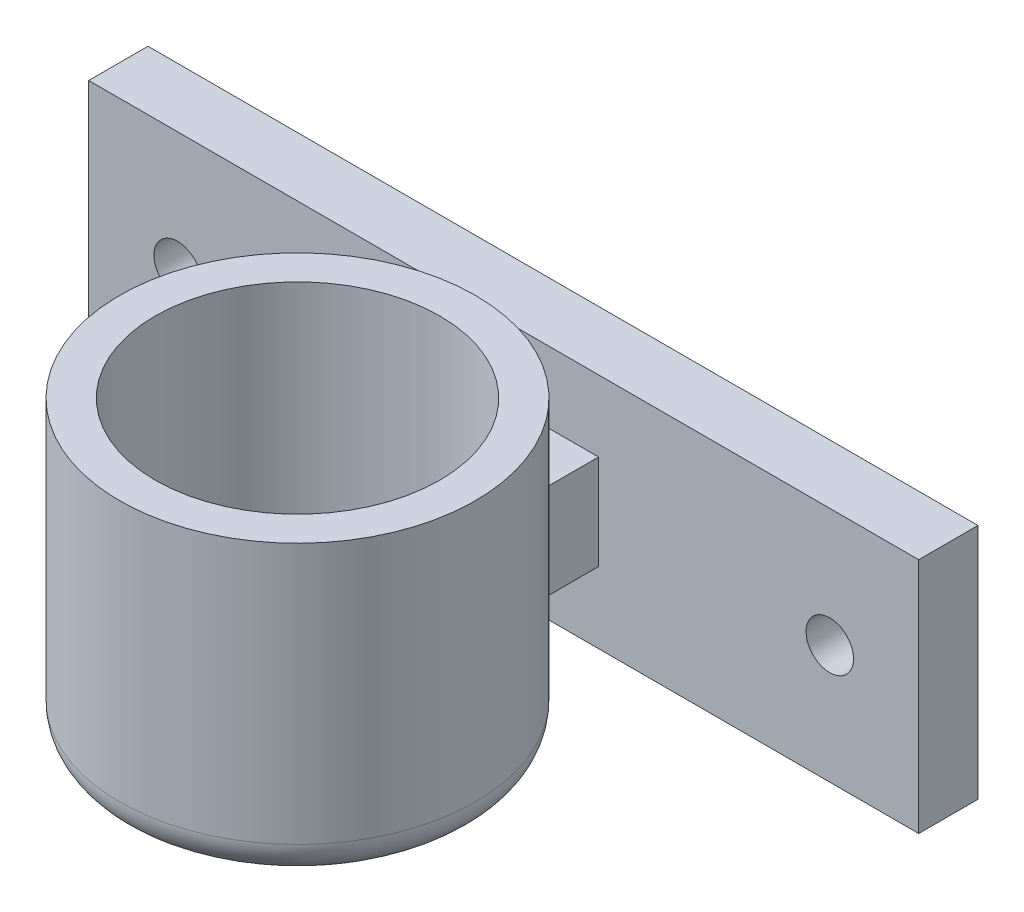
ISO-10303-21;
HEADER;
FILE_DESCRIPTION(('STEP AP214'),'2;1');
FILE_NAME('part.step','',(''),(''),'','','');
FILE_SCHEMA(('AUTOMOTIVE_DESIGN { 1 0 10303 214 1 1 1 1 }'));
ENDSEC;
DATA;
#1=APPLICATION_CONTEXT('core data for automotive mechanical design processes');
#2=APPLICATION_PROTOCOL_DEFINITION('international standard','automotive_design',2000,#1);
#3=PRODUCT_CONTEXT('',#1,'mechanical');
#4=PRODUCT('Part','Part','',(#3));
#5=PRODUCT_RELATED_PRODUCT_CATEGORY('part','',(#4));
#6=PRODUCT_DEFINITION_FORMATION('','',#4);
#7=PRODUCT_DEFINITION_CONTEXT('part definition',#1,'design');
#8=PRODUCT_DEFINITION('design','',#6,#7);
#9=PRODUCT_DEFINITION_SHAPE('','',#8);
#10=(LENGTH_UNIT() NAMED_UNIT(*) SI_UNIT(.MILLI.,.METRE.));
#11=(NAMED_UNIT(*) PLANE_ANGLE_UNIT() SI_UNIT($,.RADIAN.));
#12=(NAMED_UNIT(*) SI_UNIT($,.STERADIAN.) SOLID_ANGLE_UNIT());
#13=UNCERTAINTY_MEASURE_WITH_UNIT(LENGTH_MEASURE(1.E-05),#10,'distance_accuracy_value','');
#14=(GEOMETRIC_REPRESENTATION_CONTEXT(3) GLOBAL_UNCERTAINTY_ASSIGNED_CONTEXT((#13)) GLOBAL_UNIT_ASSIGNED_CONTEXT((#10,
#11,#12)) REPRESENTATION_CONTEXT('',''));
#15=CARTESIAN_POINT('',(0.,0.,0.));
#16=DIRECTION('',(0.,0.,1.));
#17=DIRECTION('',(1.,0.,0.));
#18=AXIS2_PLACEMENT_3D('',#15,#16,#17);
#19=CARTESIAN_POINT('',(-2.34426229508198,24.655737704918,7.5));
#20=DIRECTION('',(1.,0.,0.));
#21=DIRECTION('',(0.,1.,0.));
#22=AXIS2_PLACEMENT_3D('',#19,#20,#21);
#23=PLANE('',#22);
#24=DIRECTION('',(0.,1.,0.));
#25=VECTOR('',#24,1.);
#26=CARTESIAN_POINT('',(-2.34426229508197,11.655737704918,7.20006627770313));
#27=LINE('',#26,#25);
#28=CARTESIAN_POINT('',(-2.34426229508198,24.655737704918,7.20006627770313));
#29=VERTEX_POINT('',#28);
#30=CARTESIAN_POINT('',(-2.34426229508198,16.655737704918,7.20006627770313));
#31=VERTEX_POINT('',#30);
#32=EDGE_CURVE('E115',#29,#31,#27,.F.);
#33=ORIENTED_EDGE('',*,*,#32,.F.);
#34=DIRECTION('',(0.,0.,-1.));
#35=VECTOR('',#34,1.);
#36=CARTESIAN_POINT('',(-2.34426229508198,24.655737704918,7.5));
#37=LINE('',#36,#35);
#38=CARTESIAN_POINT('',(-2.34426229508198,24.655737704918,2.5));
#39=VERTEX_POINT('',#38);
#40=EDGE_CURVE('E101',#29,#39,#37,.T.);
#41=ORIENTED_EDGE('',*,*,#40,.T.);
#42=DIRECTION('',(0.,-1.,0.));
#43=VECTOR('',#42,1.);
#44=CARTESIAN_POINT('',(-2.34426229508198,24.655737704918,2.5));
#45=LINE('',#44,#43);
#46=CARTESIAN_POINT('',(-2.34426229508198,16.655737704918,2.5));
#47=VERTEX_POINT('',#46);
#48=EDGE_CURVE('E117',#39,#47,#45,.T.);
#49=ORIENTED_EDGE('',*,*,#48,.T.);
#50=DIRECTION('',(0.,0.,-1.));
#51=VECTOR('',#50,1.);
#52=CARTESIAN_POINT('',(-2.34426229508198,16.655737704918,7.5));
#53=LINE('',#52,#51);
#54=EDGE_CURVE('E112',#31,#47,#53,.T.);
#55=ORIENTED_EDGE('',*,*,#54,.F.);
#56=EDGE_LOOP('',(#33,#41,#49,#55));
#57=FACE_BOUND('',#56,.T.);
#58=ADVANCED_FACE('F36',(#57),#23,.F.);
#59=CARTESIAN_POINT('',(13.655737704918,24.655737704918,7.5));
#60=DIRECTION('',(-1.,0.,0.));
#61=DIRECTION('',(0.,-1.,0.));
#62=AXIS2_PLACEMENT_3D('',#59,#60,#61);
#63=PLANE('',#62);
#64=DIRECTION('',(0.,1.,0.));
#65=VECTOR('',#64,1.);
#66=CARTESIAN_POINT('',(13.655737704918,11.655737704918,7.20006627770314));
#67=LINE('',#66,#65);
#68=CARTESIAN_POINT('',(13.655737704918,16.6557377049181,7.20006627770314));
#69=VERTEX_POINT('',#68);
#70=CARTESIAN_POINT('',(13.655737704918,24.655737704918,7.20006627770314));
#71=VERTEX_POINT('',#70);
#72=EDGE_CURVE('E59',#69,#71,#67,.T.);
#73=ORIENTED_EDGE('',*,*,#72,.F.);
#74=DIRECTION('',(0.,0.,-1.));
#75=VECTOR('',#74,1.);
#76=CARTESIAN_POINT('',(13.655737704918,16.6557377049181,7.5));
#77=LINE('',#76,#75);
#78=CARTESIAN_POINT('',(13.655737704918,16.6557377049181,2.5));
#79=VERTEX_POINT('',#78);
#80=EDGE_CURVE('E165',#69,#79,#77,.T.);
#81=ORIENTED_EDGE('',*,*,#80,.T.);
#82=DIRECTION('',(0.,1.,0.));
#83=VECTOR('',#82,1.);
#84=CARTESIAN_POINT('',(13.655737704918,24.655737704918,2.5));
#85=LINE('',#84,#83);
#86=CARTESIAN_POINT('',(13.655737704918,24.655737704918,2.5));
#87=VERTEX_POINT('',#86);
#88=EDGE_CURVE('E170',#79,#87,#85,.T.);
#89=ORIENTED_EDGE('',*,*,#88,.T.);
#90=DIRECTION('',(0.,0.,-1.));
#91=VECTOR('',#90,1.);
#92=CARTESIAN_POINT('',(13.655737704918,24.655737704918,7.5));
#93=LINE('',#92,#91);
#94=EDGE_CURVE('E167',#71,#87,#93,.T.);
#95=ORIENTED_EDGE('',*,*,#94,.F.);
#96=EDGE_LOOP('',(#73,#81,#89,#95));
#97=FACE_BOUND('',#96,.T.);
#98=ADVANCED_FACE('F214',(#97),#63,.F.);
#99=CARTESIAN_POINT('',(0.,0.,2.5));
#100=DIRECTION('',(0.,0.,-1.));
#101=DIRECTION('',(-1.,0.,0.));
#102=AXIS2_PLACEMENT_3D('',#99,#100,#101);
#103=PLANE('',#102);
#104=CARTESIAN_POINT('',(33.155737704918,20.655737704918,2.5));
#105=DIRECTION('',(0.,0.,1.));
#106=DIRECTION('',(1.,0.,0.));
#107=AXIS2_PLACEMENT_3D('',#104,#105,#106);
#108=CIRCLE('',#107,2.);
#109=CARTESIAN_POINT('',(35.155737704918,20.655737704918,2.5));
#110=VERTEX_POINT('',#109);
#111=EDGE_CURVE('E157',#110,#110,#108,.T.);
#112=ORIENTED_EDGE('',*,*,#111,.F.);
#113=EDGE_LOOP('',(#112));
#114=FACE_BOUND('',#113,.T.);
#115=CARTESIAN_POINT('',(-21.844262295082,20.655737704918,2.5));
#116=DIRECTION('',(0.,0.,1.));
#117=DIRECTION('',(1.,0.,0.));
#118=AXIS2_PLACEMENT_3D('',#115,#116,#117);
#119=CIRCLE('',#118,2.);
#120=CARTESIAN_POINT('',(-19.844262295082,20.655737704918,2.5));
#121=VERTEX_POINT('',#120);
#122=EDGE_CURVE('E146',#121,#121,#119,.T.);
#123=ORIENTED_EDGE('',*,*,#122,.F.);
#124=EDGE_LOOP('',(#123));
#125=FACE_BOUND('',#124,.T.);
#126=DIRECTION('',(0.,-1.,0.));
#127=VECTOR('',#126,1.);
#128=CARTESIAN_POINT('',(-29.344262295082,30.655737704918,2.5));
#129=LINE('',#128,#127);
#130=CARTESIAN_POINT('',(-29.344262295082,30.655737704918,2.5));
#131=VERTEX_POINT('',#130);
#132=CARTESIAN_POINT('',(-29.344262295082,10.655737704918,2.5));
#133=VERTEX_POINT('',#132);
#134=EDGE_CURVE('E138',#131,#133,#129,.T.);
#135=ORIENTED_EDGE('',*,*,#134,.T.);
#136=DIRECTION('',(1.,0.,0.));
#137=VECTOR('',#136,1.);
#138=CARTESIAN_POINT('',(40.655737704918,10.655737704918,2.5));
#139=LINE('',#138,#137);
#140=CARTESIAN_POINT('',(40.655737704918,10.655737704918,2.5));
#141=VERTEX_POINT('',#140);
#142=EDGE_CURVE('E150',#133,#141,#139,.T.);
#143=ORIENTED_EDGE('',*,*,#142,.T.);
#144=DIRECTION('',(0.,1.,0.));
#145=VECTOR('',#144,1.);
#146=CARTESIAN_POINT('',(40.655737704918,30.655737704918,2.5));
#147=LINE('',#146,#145);
#148=CARTESIAN_POINT('',(40.655737704918,30.655737704918,2.5));
#149=VERTEX_POINT('',#148);
#150=EDGE_CURVE('E148',#141,#149,#147,.T.);
#151=ORIENTED_EDGE('',*,*,#150,.T.);
#152=DIRECTION('',(-1.,0.,0.));
#153=VECTOR('',#152,1.);
#154=CARTESIAN_POINT('',(-29.344262295082,30.655737704918,2.5));
#155=LINE('',#154,#153);
#156=EDGE_CURVE('E135',#149,#131,#155,.T.);
#157=ORIENTED_EDGE('',*,*,#156,.T.);
#158=EDGE_LOOP('',(#135,#143,#151,#157));
#159=FACE_BOUND('',#158,.T.);
#160=ORIENTED_EDGE('',*,*,#48,.F.);
#161=DIRECTION('',(-1.,0.,0.));
#162=VECTOR('',#161,1.);
#163=CARTESIAN_POINT('',(5.65573770491802,24.655737704918,2.5));
#164=LINE('',#163,#162);
#165=EDGE_CURVE('E107',#87,#39,#164,.T.);
#166=ORIENTED_EDGE('',*,*,#165,.F.);
#167=ORIENTED_EDGE('',*,*,#88,.F.);
#168=DIRECTION('',(1.,0.,0.));
#169=VECTOR('',#168,1.);
#170=CARTESIAN_POINT('',(13.655737704918,16.6557377049181,2.5));
#171=LINE('',#170,#169);
#172=EDGE_CURVE('E173',#47,#79,#171,.T.);
#173=ORIENTED_EDGE('',*,*,#172,.F.);
#174=EDGE_LOOP('',(#160,#166,#167,#173));
#175=FACE_BOUND('',#174,.T.);
#176=ADVANCED_FACE('F219',(#114,#125,#159,#175),#103,.F.);
#177=CARTESIAN_POINT('',(0.,0.,-2.5));
#178=DIRECTION('',(0.,0.,-1.));
#179=DIRECTION('',(-1.,0.,0.));
#180=AXIS2_PLACEMENT_3D('',#177,#178,#179);
#181=PLANE('',#180);
#182=CARTESIAN_POINT('',(-21.844262295082,20.655737704918,-2.5));
#183=DIRECTION('',(0.,0.,1.));
#184=DIRECTION('',(1.,0.,0.));
#185=AXIS2_PLACEMENT_3D('',#182,#183,#184);
#186=CIRCLE('',#185,2.);
#187=CARTESIAN_POINT('',(-19.844262295082,20.655737704918,-2.5));
#188=VERTEX_POINT('',#187);
#189=EDGE_CURVE('E154',#188,#188,#186,.T.);
#190=ORIENTED_EDGE('',*,*,#189,.T.);
#191=EDGE_LOOP('',(#190));
#192=FACE_BOUND('',#191,.T.);
#193=DIRECTION('',(0.,-1.,0.));
#194=VECTOR('',#193,1.);
#195=CARTESIAN_POINT('',(-29.344262295082,30.655737704918,-2.5));
#196=LINE('',#195,#194);
#197=CARTESIAN_POINT('',(-29.344262295082,30.655737704918,-2.5));
#198=VERTEX_POINT('',#197);
#199=CARTESIAN_POINT('',(-29.344262295082,10.655737704918,-2.5));
#200=VERTEX_POINT('',#199);
#201=EDGE_CURVE('E143',#198,#200,#196,.T.);
#202=ORIENTED_EDGE('',*,*,#201,.F.);
#203=DIRECTION('',(-1.,0.,0.));
#204=VECTOR('',#203,1.);
#205=CARTESIAN_POINT('',(-29.344262295082,30.655737704918,-2.5));
#206=LINE('',#205,#204);
#207=CARTESIAN_POINT('',(40.655737704918,30.655737704918,-2.5));
#208=VERTEX_POINT('',#207);
#209=EDGE_CURVE('E136',#208,#198,#206,.T.);
#210=ORIENTED_EDGE('',*,*,#209,.F.);
#211=DIRECTION('',(0.,1.,0.));
#212=VECTOR('',#211,1.);
#213=CARTESIAN_POINT('',(40.655737704918,30.655737704918,-2.5));
#214=LINE('',#213,#212);
#215=CARTESIAN_POINT('',(40.655737704918,10.655737704918,-2.5));
#216=VERTEX_POINT('',#215);
#217=EDGE_CURVE('E139',#216,#208,#214,.T.);
#218=ORIENTED_EDGE('',*,*,#217,.F.);
#219=DIRECTION('',(1.,0.,0.));
#220=VECTOR('',#219,1.);
#221=CARTESIAN_POINT('',(40.655737704918,10.655737704918,-2.5));
#222=LINE('',#221,#220);
#223=EDGE_CURVE('E141',#200,#216,#222,.T.);
#224=ORIENTED_EDGE('',*,*,#223,.F.);
#225=EDGE_LOOP('',(#202,#210,#218,#224));
#226=FACE_BOUND('',#225,.T.);
#227=CARTESIAN_POINT('',(33.155737704918,20.655737704918,-2.5));
#228=DIRECTION('',(0.,0.,1.));
#229=DIRECTION('',(1.,0.,0.));
#230=AXIS2_PLACEMENT_3D('',#227,#228,#229);
#231=CIRCLE('',#230,2.);
#232=CARTESIAN_POINT('',(35.155737704918,20.655737704918,-2.5));
#233=VERTEX_POINT('',#232);
#234=EDGE_CURVE('E111',#233,#233,#231,.T.);
#235=ORIENTED_EDGE('',*,*,#234,.T.);
#236=EDGE_LOOP('',(#235));
#237=FACE_BOUND('',#236,.T.);
#238=ADVANCED_FACE('F235',(#192,#226,#237),#181,.T.);
#239=CARTESIAN_POINT('',(-29.344262295082,30.655737704918,2.5));
#240=DIRECTION('',(1.,0.,0.));
#241=DIRECTION('',(0.,0.,-1.));
#242=AXIS2_PLACEMENT_3D('',#239,#240,#241);
#243=PLANE('',#242);
#244=ORIENTED_EDGE('',*,*,#201,.T.);
#245=DIRECTION('',(0.,0.,-1.));
#246=VECTOR('',#245,1.);
#247=CARTESIAN_POINT('',(-29.344262295082,10.655737704918,2.5));
#248=LINE('',#247,#246);
#249=EDGE_CURVE('E120',#133,#200,#248,.T.);
#250=ORIENTED_EDGE('',*,*,#249,.F.);
#251=ORIENTED_EDGE('',*,*,#134,.F.);
#252=DIRECTION('',(0.,0.,-1.));
#253=VECTOR('',#252,1.);
#254=CARTESIAN_POINT('',(-29.344262295082,30.655737704918,2.5));
#255=LINE('',#254,#253);
#256=EDGE_CURVE('E132',#131,#198,#255,.T.);
#257=ORIENTED_EDGE('',*,*,#256,.T.);
#258=EDGE_LOOP('',(#244,#250,#251,#257));
#259=FACE_BOUND('',#258,.T.);
#260=ADVANCED_FACE('F239',(#259),#243,.F.);
#261=CARTESIAN_POINT('',(40.655737704918,10.655737704918,2.5));
#262=DIRECTION('',(0.,1.,0.));
#263=DIRECTION('',(-1.,0.,0.));
#264=AXIS2_PLACEMENT_3D('',#261,#262,#263);
#265=PLANE('',#264);
#266=ORIENTED_EDGE('',*,*,#223,.T.);
#267=DIRECTION('',(0.,0.,-1.));
#268=VECTOR('',#267,1.);
#269=CARTESIAN_POINT('',(40.655737704918,10.655737704918,2.5));
#270=LINE('',#269,#268);
#271=EDGE_CURVE('E124',#141,#216,#270,.T.);
#272=ORIENTED_EDGE('',*,*,#271,.F.);
#273=ORIENTED_EDGE('',*,*,#142,.F.);
#274=ORIENTED_EDGE('',*,*,#249,.T.);
#275=EDGE_LOOP('',(#266,#272,#273,#274));
#276=FACE_BOUND('',#275,.T.);
#277=ADVANCED_FACE('F247',(#276),#265,.F.);
#278=CARTESIAN_POINT('',(40.655737704918,30.655737704918,2.5));
#279=DIRECTION('',(-1.,0.,0.));
#280=DIRECTION('',(0.,0.,1.));
#281=AXIS2_PLACEMENT_3D('',#278,#279,#280);
#282=PLANE('',#281);
#283=ORIENTED_EDGE('',*,*,#217,.T.);
#284=DIRECTION('',(0.,0.,-1.));
#285=VECTOR('',#284,1.);
#286=CARTESIAN_POINT('',(40.655737704918,30.655737704918,2.5));
#287=LINE('',#286,#285);
#288=EDGE_CURVE('E129',#149,#208,#287,.T.);
#289=ORIENTED_EDGE('',*,*,#288,.F.);
#290=ORIENTED_EDGE('',*,*,#150,.F.);
#291=ORIENTED_EDGE('',*,*,#271,.T.);
#292=EDGE_LOOP('',(#283,#289,#290,#291));
#293=FACE_BOUND('',#292,.T.);
#294=ADVANCED_FACE('F243',(#293),#282,.F.);
#295=CARTESIAN_POINT('',(-29.344262295082,30.655737704918,2.5));
#296=DIRECTION('',(0.,-1.,0.));
#297=DIRECTION('',(0.,0.,-1.));
#298=AXIS2_PLACEMENT_3D('',#295,#296,#297);
#299=PLANE('',#298);
#300=ORIENTED_EDGE('',*,*,#209,.T.);
#301=ORIENTED_EDGE('',*,*,#256,.F.);
#302=ORIENTED_EDGE('',*,*,#156,.F.);
#303=ORIENTED_EDGE('',*,*,#288,.T.);
#304=EDGE_LOOP('',(#300,#301,#302,#303));
#305=FACE_BOUND('',#304,.T.);
#306=ADVANCED_FACE('F231',(#305),#299,.F.);
#307=CARTESIAN_POINT('',(-21.844262295082,20.655737704918,2.5));
#308=DIRECTION('',(0.,0.,-1.));
#309=DIRECTION('',(-1.,0.,0.));
#310=AXIS2_PLACEMENT_3D('',#307,#308,#309);
#311=CYLINDRICAL_SURFACE('',#310,2.);
#312=ORIENTED_EDGE('',*,*,#122,.T.);
#313=EDGE_LOOP('',(#312));
#314=FACE_BOUND('',#313,.T.);
#315=ORIENTED_EDGE('',*,*,#189,.F.);
#316=EDGE_LOOP('',(#315));
#317=FACE_BOUND('',#316,.T.);
#318=ADVANCED_FACE('F227',(#314,#317),#311,.F.);
#319=CARTESIAN_POINT('',(33.155737704918,20.655737704918,2.5));
#320=DIRECTION('',(0.,0.,-1.));
#321=DIRECTION('',(-1.,0.,0.));
#322=AXIS2_PLACEMENT_3D('',#319,#320,#321);
#323=CYLINDRICAL_SURFACE('',#322,2.);
#324=ORIENTED_EDGE('',*,*,#111,.T.);
#325=EDGE_LOOP('',(#324));
#326=FACE_BOUND('',#325,.T.);
#327=ORIENTED_EDGE('',*,*,#234,.F.);
#328=EDGE_LOOP('',(#327));
#329=FACE_BOUND('',#328,.T.);
#330=ADVANCED_FACE('F224',(#326,#329),#323,.F.);
#331=CARTESIAN_POINT('',(13.655737704918,16.6557377049181,7.5));
#332=DIRECTION('',(0.,1.,0.));
#333=DIRECTION('',(-1.,0.,0.));
#334=AXIS2_PLACEMENT_3D('',#331,#332,#333);
#335=PLANE('',#334);
#336=CARTESIAN_POINT('',(5.65573770491802,16.655737704918,19.8886438181527));
#337=DIRECTION('',(0.,1.,0.));
#338=DIRECTION('',(-1.,0.,0.));
#339=AXIS2_PLACEMENT_3D('',#336,#337,#338);
#340=CIRCLE('',#339,15.);
#341=EDGE_CURVE('E51',#31,#69,#340,.F.);
#342=ORIENTED_EDGE('',*,*,#341,.F.);
#343=ORIENTED_EDGE('',*,*,#54,.T.);
#344=ORIENTED_EDGE('',*,*,#172,.T.);
#345=ORIENTED_EDGE('',*,*,#80,.F.);
#346=EDGE_LOOP('',(#342,#343,#344,#345));
#347=FACE_BOUND('',#346,.T.);
#348=ADVANCED_FACE('F223',(#347),#335,.F.);
#349=CARTESIAN_POINT('',(5.65573770491802,24.655737704918,7.5));
#350=DIRECTION('',(0.,-1.,0.));
#351=DIRECTION('',(0.,0.,-1.));
#352=AXIS2_PLACEMENT_3D('',#349,#350,#351);
#353=PLANE('',#352);
#354=CARTESIAN_POINT('',(5.65573770491802,24.655737704918,19.8886438181527));
#355=DIRECTION('',(0.,-1.,0.));
#356=DIRECTION('',(0.,0.,-1.));
#357=AXIS2_PLACEMENT_3D('',#354,#355,#356);
#358=CIRCLE('',#357,15.);
#359=EDGE_CURVE('E105',#71,#29,#358,.F.);
#360=ORIENTED_EDGE('',*,*,#359,.F.);
#361=ORIENTED_EDGE('',*,*,#94,.T.);
#362=ORIENTED_EDGE('',*,*,#165,.T.);
#363=ORIENTED_EDGE('',*,*,#40,.F.);
#364=EDGE_LOOP('',(#360,#361,#362,#363));
#365=FACE_BOUND('',#364,.T.);
#366=ADVANCED_FACE('F103',(#365),#353,.F.);
#367=CARTESIAN_POINT('',(5.65573770491802,11.655737704918,19.8886438181527));
#368=DIRECTION('',(0.,1.,0.));
#369=DIRECTION('',(0.,0.,1.));
#370=AXIS2_PLACEMENT_3D('',#367,#368,#369);
#371=CYLINDRICAL_SURFACE('',#370,15.);
#372=CARTESIAN_POINT('',(5.65573770491802,11.655737704918,19.8886438181527));
#373=DIRECTION('',(0.,-1.,0.));
#374=DIRECTION('',(0.,0.,-1.));
#375=AXIS2_PLACEMENT_3D('',#372,#373,#374);
#376=CIRCLE('',#375,15.);
#377=CARTESIAN_POINT('',(5.65573770491802,11.655737704918,4.88864381815266));
#378=VERTEX_POINT('',#377);
#379=EDGE_CURVE('E11',#378,#378,#376,.F.);
#380=ORIENTED_EDGE('',*,*,#379,.T.);
#381=EDGE_LOOP('',(#380));
#382=FACE_BOUND('',#381,.T.);
#383=CARTESIAN_POINT('',(5.65573770491802,33.655737704918,19.8886438181527));
#384=DIRECTION('',(0.,-1.,0.));
#385=DIRECTION('',(0.,0.,-1.));
#386=AXIS2_PLACEMENT_3D('',#383,#384,#385);
#387=CIRCLE('',#386,15.);
#388=CARTESIAN_POINT('',(5.65573770491802,33.655737704918,4.88864381815266));
#389=VERTEX_POINT('',#388);
#390=EDGE_CURVE('E179',#389,#389,#387,.T.);
#391=ORIENTED_EDGE('',*,*,#390,.T.);
#392=EDGE_LOOP('',(#391));
#393=FACE_BOUND('',#392,.T.);
#394=ORIENTED_EDGE('',*,*,#359,.T.);
#395=ORIENTED_EDGE('',*,*,#32,.T.);
#396=ORIENTED_EDGE('',*,*,#341,.T.);
#397=ORIENTED_EDGE('',*,*,#72,.T.);
#398=EDGE_LOOP('',(#394,#395,#396,#397));
#399=FACE_BOUND('',#398,.T.);
#400=ADVANCED_FACE('F119',(#382,#393,#399),#371,.T.);
#401=CARTESIAN_POINT('',(5.65573770491802,11.655737704918,19.8886438181527));
#402=DIRECTION('',(0.,1.,0.));
#403=DIRECTION('',(0.,0.,1.));
#404=AXIS2_PLACEMENT_3D('',#401,#402,#403);
#405=CYLINDRICAL_SURFACE('',#404,12.);
#406=CARTESIAN_POINT('',(5.65573770491802,11.655737704918,19.8886438181527));
#407=DIRECTION('',(0.,-1.,0.));
#408=DIRECTION('',(0.,0.,-1.));
#409=AXIS2_PLACEMENT_3D('',#406,#407,#408);
#410=CIRCLE('',#409,12.);
#411=CARTESIAN_POINT('',(5.65573770491802,11.655737704918,7.88864381815265));
#412=VERTEX_POINT('',#411);
#413=EDGE_CURVE('E180',#412,#412,#410,.T.);
#414=ORIENTED_EDGE('',*,*,#413,.T.);
#415=EDGE_LOOP('',(#414));
#416=FACE_BOUND('',#415,.T.);
#417=CARTESIAN_POINT('',(5.65573770491802,33.655737704918,19.8886438181527));
#418=DIRECTION('',(0.,-1.,0.));
#419=DIRECTION('',(0.,0.,-1.));
#420=AXIS2_PLACEMENT_3D('',#417,#418,#419);
#421=CIRCLE('',#420,12.);
#422=CARTESIAN_POINT('',(5.65573770491802,33.655737704918,7.88864381815265));
#423=VERTEX_POINT('',#422);
#424=EDGE_CURVE('E183',#423,#423,#421,.T.);
#425=ORIENTED_EDGE('',*,*,#424,.F.);
#426=EDGE_LOOP('',(#425));
#427=FACE_BOUND('',#426,.T.);
#428=ADVANCED_FACE('F279',(#416,#427),#405,.F.);
#429=CARTESIAN_POINT('',(5.65573770491802,33.655737704918,19.8886438181527));
#430=DIRECTION('',(0.,-1.,0.));
#431=DIRECTION('',(0.,0.,-1.));
#432=AXIS2_PLACEMENT_3D('',#429,#430,#431);
#433=PLANE('',#432);
#434=ORIENTED_EDGE('',*,*,#424,.T.);
#435=EDGE_LOOP('',(#434));
#436=FACE_BOUND('',#435,.T.);
#437=ORIENTED_EDGE('',*,*,#390,.F.);
#438=EDGE_LOOP('',(#437));
#439=FACE_BOUND('',#438,.T.);
#440=ADVANCED_FACE('F211',(#436,#439),#433,.F.);
#441=CARTESIAN_POINT('',(5.65573770491802,11.655737704918,19.8886438181527));
#442=DIRECTION('',(0.,-1.,0.));
#443=DIRECTION('',(0.,0.,-1.));
#444=AXIS2_PLACEMENT_3D('',#441,#442,#443);
#445=PLANE('',#444);
#446=CARTESIAN_POINT('',(5.65573770491802,11.655737704918,19.8886438181527));
#447=DIRECTION('',(0.,-1.,0.));
#448=DIRECTION('',(0.,0.,-1.));
#449=AXIS2_PLACEMENT_3D('',#446,#447,#448);
#450=CIRCLE('',#449,2.5);
#451=CARTESIAN_POINT('',(5.65573770491802,11.655737704918,17.3886438181527));
#452=VERTEX_POINT('',#451);
#453=EDGE_CURVE('E184',#452,#452,#450,.T.);
#454=ORIENTED_EDGE('',*,*,#453,.T.);
#455=EDGE_LOOP('',(#454));
#456=FACE_BOUND('',#455,.T.);
#457=ORIENTED_EDGE('',*,*,#413,.F.);
#458=EDGE_LOOP('',(#457));
#459=FACE_BOUND('',#458,.T.);
#460=ADVANCED_FACE('F195',(#456,#459),#445,.F.);
#461=CARTESIAN_POINT('',(5.65573770491802,8.65573770491804,19.8886438181527));
#462=DIRECTION('',(0.,-1.,0.));
#463=DIRECTION('',(0.,0.,-1.));
#464=AXIS2_PLACEMENT_3D('',#461,#462,#463);
#465=PLANE('',#464);
#466=CARTESIAN_POINT('',(5.65573770491802,8.65573770491804,19.8886438181527));
#467=DIRECTION('',(0.,-1.,0.));
#468=DIRECTION('',(0.,0.,-1.));
#469=AXIS2_PLACEMENT_3D('',#466,#467,#468);
#470=CIRCLE('',#469,12.);
#471=CARTESIAN_POINT('',(5.65573770491802,8.65573770491804,7.88864381815265));
#472=VERTEX_POINT('',#471);
#473=EDGE_CURVE('E44',#472,#472,#470,.T.);
#474=ORIENTED_EDGE('',*,*,#473,.T.);
#475=EDGE_LOOP('',(#474));
#476=FACE_BOUND('',#475,.T.);
#477=CARTESIAN_POINT('',(5.65573770491802,8.65573770491804,19.8886438181527));
#478=DIRECTION('',(0.,-1.,0.));
#479=DIRECTION('',(0.,0.,-1.));
#480=AXIS2_PLACEMENT_3D('',#477,#478,#479);
#481=CIRCLE('',#480,2.5);
#482=CARTESIAN_POINT('',(5.65573770491802,8.65573770491804,17.3886438181527));
#483=VERTEX_POINT('',#482);
#484=EDGE_CURVE('E189',#483,#483,#481,.T.);
#485=ORIENTED_EDGE('',*,*,#484,.F.);
#486=EDGE_LOOP('',(#485));
#487=FACE_BOUND('',#486,.T.);
#488=ADVANCED_FACE('F201',(#476,#487),#465,.T.);
#489=CARTESIAN_POINT('',(5.65573770491802,11.655737704918,19.8886438181527));
#490=DIRECTION('',(0.,-1.,0.));
#491=DIRECTION('',(0.,0.,-1.));
#492=AXIS2_PLACEMENT_3D('',#489,#490,#491);
#493=CYLINDRICAL_SURFACE('',#492,2.5);
#494=ORIENTED_EDGE('',*,*,#453,.F.);
#495=EDGE_LOOP('',(#494));
#496=FACE_BOUND('',#495,.T.);
#497=ORIENTED_EDGE('',*,*,#484,.T.);
#498=EDGE_LOOP('',(#497));
#499=FACE_BOUND('',#498,.T.);
#500=ADVANCED_FACE('F198',(#496,#499),#493,.F.);
#501=CARTESIAN_POINT('',(5.65573770491802,11.655737704918,19.8886438181527));
#502=DIRECTION('',(0.,-1.,0.));
#503=DIRECTION('',(0.,0.,-1.));
#504=AXIS2_PLACEMENT_3D('',#501,#502,#503);
#505=TOROIDAL_SURFACE('',#504,12.,3.);
#506=ORIENTED_EDGE('',*,*,#379,.F.);
#507=EDGE_LOOP('',(#506));
#508=FACE_BOUND('',#507,.T.);
#509=ORIENTED_EDGE('',*,*,#473,.F.);
#510=EDGE_LOOP('',(#509));
#511=FACE_BOUND('',#510,.T.);
#512=ADVANCED_FACE('F38',(#508,#511),#505,.T.);
#513=CLOSED_SHELL('',(#58,#98,#176,#238,#260,#277,#294,#306,#318,#330,#348,#366,#400,#428,#440,
#460,#488,#500,#512));
#514=MANIFOLD_SOLID_BREP('B2',#513);
#515=ADVANCED_BREP_SHAPE_REPRESENTATION('',(#18,#514),#14);
#516=SHAPE_DEFINITION_REPRESENTATION(#9,#515);
ENDSEC;
END-ISO-10303-21;
